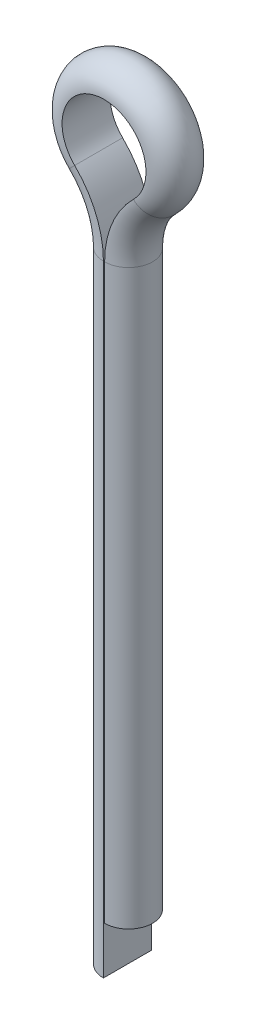
ISO-10303-21;
HEADER;
FILE_DESCRIPTION(('STEP AP214'),'2;1');
FILE_NAME('part.step','',(''),(''),'','','');
FILE_SCHEMA(('AUTOMOTIVE_DESIGN { 1 0 10303 214 1 1 1 1 }'));
ENDSEC;
DATA;
#1=APPLICATION_CONTEXT('core data for automotive mechanical design processes');
#2=APPLICATION_PROTOCOL_DEFINITION('international standard','automotive_design',2000,#1);
#3=PRODUCT_CONTEXT('',#1,'mechanical');
#4=PRODUCT('Part','Part','',(#3));
#5=PRODUCT_RELATED_PRODUCT_CATEGORY('part','',(#4));
#6=PRODUCT_DEFINITION_FORMATION('','',#4);
#7=PRODUCT_DEFINITION_CONTEXT('part definition',#1,'design');
#8=PRODUCT_DEFINITION('design','',#6,#7);
#9=PRODUCT_DEFINITION_SHAPE('','',#8);
#10=(LENGTH_UNIT() NAMED_UNIT(*) SI_UNIT(.MILLI.,.METRE.));
#11=(NAMED_UNIT(*) PLANE_ANGLE_UNIT() SI_UNIT($,.RADIAN.));
#12=(NAMED_UNIT(*) SI_UNIT($,.STERADIAN.) SOLID_ANGLE_UNIT());
#13=UNCERTAINTY_MEASURE_WITH_UNIT(LENGTH_MEASURE(1.E-05),#10,'distance_accuracy_value','');
#14=(GEOMETRIC_REPRESENTATION_CONTEXT(3) GLOBAL_UNCERTAINTY_ASSIGNED_CONTEXT((#13)) GLOBAL_UNIT_ASSIGNED_CONTEXT((#10,
#11,#12)) REPRESENTATION_CONTEXT('',''));
#15=CARTESIAN_POINT('',(0.,0.,0.));
#16=DIRECTION('',(0.,0.,1.));
#17=DIRECTION('',(1.,0.,0.));
#18=AXIS2_PLACEMENT_3D('',#15,#16,#17);
#19=CARTESIAN_POINT('',(-35.7565268699896,29.9749147988003,0.999999999999894));
#20=DIRECTION('',(-1.,0.,0.));
#21=DIRECTION('',(0.,0.,1.));
#22=AXIS2_PLACEMENT_3D('',#19,#20,#21);
#23=PLANE('',#22);
#24=DIRECTION('',(0.,0.,-1.));
#25=VECTOR('',#24,1.);
#26=CARTESIAN_POINT('',(-35.7565268699896,29.9749147988003,0.999999999999894));
#27=LINE('',#26,#25);
#28=CARTESIAN_POINT('',(-35.7565268699896,29.9749147988003,0.999999999999894));
#29=VERTEX_POINT('',#28);
#30=CARTESIAN_POINT('',(-35.7565268699896,29.9749147988003,-1.00000000000011));
#31=VERTEX_POINT('',#30);
#32=EDGE_CURVE('E141',#29,#31,#27,.T.);
#33=ORIENTED_EDGE('',*,*,#32,.F.);
#34=DIRECTION('',(0.,-1.,0.));
#35=VECTOR('',#34,1.);
#36=CARTESIAN_POINT('',(-35.7565268699896,29.9749147988003,0.999999999999894));
#37=LINE('',#36,#35);
#38=CARTESIAN_POINT('',(-35.7565268699896,4.08123614521241,0.999999999999894));
#39=VERTEX_POINT('',#38);
#40=EDGE_CURVE('E44',#29,#39,#37,.T.);
#41=ORIENTED_EDGE('',*,*,#40,.T.);
#42=DIRECTION('',(0.,0.,-1.));
#43=VECTOR('',#42,1.);
#44=CARTESIAN_POINT('',(-35.7565268699896,4.08123614521241,0.999999999999894));
#45=LINE('',#44,#43);
#46=CARTESIAN_POINT('',(-35.7565268699896,4.08123614521241,-1.00000000000011));
#47=VERTEX_POINT('',#46);
#48=EDGE_CURVE('E51',#39,#47,#45,.T.);
#49=ORIENTED_EDGE('',*,*,#48,.T.);
#50=DIRECTION('',(0.,-1.,0.));
#51=VECTOR('',#50,1.);
#52=CARTESIAN_POINT('',(-35.7565268699896,29.9749147988003,-1.00000000000011));
#53=LINE('',#52,#51);
#54=EDGE_CURVE('E11',#31,#47,#53,.T.);
#55=ORIENTED_EDGE('',*,*,#54,.F.);
#56=EDGE_LOOP('',(#33,#41,#49,#55));
#57=FACE_BOUND('',#56,.T.);
#58=ADVANCED_FACE('F37',(#57),#23,.F.);
#59=CARTESIAN_POINT('',(-35.7565268699896,29.9749147988003,-1.06257792384059E-13));
#60=DIRECTION('',(0.,-1.,0.));
#61=DIRECTION('',(1.,0.,0.));
#62=AXIS2_PLACEMENT_3D('',#59,#60,#61);
#63=CYLINDRICAL_SURFACE('',#62,1.);
#64=CARTESIAN_POINT('',(-35.7565268699896,29.9749147988003,-1.06257792384059E-13));
#65=DIRECTION('',(0.,-1.,0.));
#66=DIRECTION('',(1.,0.,0.));
#67=AXIS2_PLACEMENT_3D('',#64,#65,#66);
#68=CIRCLE('',#67,1.);
#69=EDGE_CURVE('E138',#29,#31,#68,.T.);
#70=ORIENTED_EDGE('',*,*,#69,.T.);
#71=ORIENTED_EDGE('',*,*,#54,.T.);
#72=CARTESIAN_POINT('',(-35.7565268699896,4.08123614521241,-1.06257792384059E-13));
#73=DIRECTION('',(0.,-1.,0.));
#74=DIRECTION('',(1.,0.,0.));
#75=AXIS2_PLACEMENT_3D('',#72,#73,#74);
#76=CIRCLE('',#75,1.);
#77=EDGE_CURVE('E57',#39,#47,#76,.T.);
#78=ORIENTED_EDGE('',*,*,#77,.F.);
#79=ORIENTED_EDGE('',*,*,#40,.F.);
#80=EDGE_LOOP('',(#70,#71,#78,#79));
#81=FACE_BOUND('',#80,.T.);
#82=ADVANCED_FACE('F153',(#81),#63,.T.);
#83=CARTESIAN_POINT('',(-39.7565268699896,29.9749147988003,-1.06257792384059E-13));
#84=DIRECTION('',(0.,0.,-1.));
#85=DIRECTION('',(-1.,0.,0.));
#86=AXIS2_PLACEMENT_3D('',#83,#84,#85);
#87=CYLINDRICAL_SURFACE('',#86,4.);
#88=DIRECTION('',(0.,0.,-1.));
#89=VECTOR('',#88,1.);
#90=CARTESIAN_POINT('',(-36.9565268699896,32.8314861702174,0.999999999999894));
#91=LINE('',#90,#89);
#92=CARTESIAN_POINT('',(-36.9565268699896,32.8314861702174,0.999999999999894));
#93=VERTEX_POINT('',#92);
#94=CARTESIAN_POINT('',(-36.9565268699896,32.8314861702174,-1.00000000000011));
#95=VERTEX_POINT('',#94);
#96=EDGE_CURVE('E129',#93,#95,#91,.T.);
#97=ORIENTED_EDGE('',*,*,#96,.F.);
#98=CARTESIAN_POINT('',(-39.7565268699896,29.9749147988003,0.999999999999894));
#99=DIRECTION('',(0.,0.,-1.));
#100=DIRECTION('',(-1.,0.,0.));
#101=AXIS2_PLACEMENT_3D('',#98,#99,#100);
#102=CIRCLE('',#101,4.);
#103=EDGE_CURVE('E144',#93,#29,#102,.T.);
#104=ORIENTED_EDGE('',*,*,#103,.T.);
#105=ORIENTED_EDGE('',*,*,#32,.T.);
#106=CARTESIAN_POINT('',(-39.7565268699896,29.9749147988003,-1.00000000000011));
#107=DIRECTION('',(0.,0.,-1.));
#108=DIRECTION('',(-1.,0.,0.));
#109=AXIS2_PLACEMENT_3D('',#106,#107,#108);
#110=CIRCLE('',#109,4.);
#111=EDGE_CURVE('E147',#95,#31,#110,.T.);
#112=ORIENTED_EDGE('',*,*,#111,.F.);
#113=EDGE_LOOP('',(#97,#104,#105,#112));
#114=FACE_BOUND('',#113,.T.);
#115=ADVANCED_FACE('F157',(#114),#87,.T.);
#116=CARTESIAN_POINT('',(-39.7565268699896,29.9749147988003,-1.06257792384059E-13));
#117=DIRECTION('',(0.,0.,-1.));
#118=DIRECTION('',(-1.,0.,0.));
#119=AXIS2_PLACEMENT_3D('',#116,#117,#118);
#120=TOROIDAL_SURFACE('',#119,4.,1.);
#121=CARTESIAN_POINT('',(-36.9565268699896,32.8314861702174,-1.06257792384059E-13));
#122=DIRECTION('',(0.714142842854295,-0.69999999999999,0.));
#123=DIRECTION('',(0.69999999999999,0.714142842854295,0.));
#124=AXIS2_PLACEMENT_3D('',#121,#122,#123);
#125=CIRCLE('',#124,1.);
#126=EDGE_CURVE('E126',#93,#95,#125,.T.);
#127=ORIENTED_EDGE('',*,*,#126,.T.);
#128=ORIENTED_EDGE('',*,*,#111,.T.);
#129=ORIENTED_EDGE('',*,*,#69,.F.);
#130=ORIENTED_EDGE('',*,*,#103,.F.);
#131=EDGE_LOOP('',(#127,#128,#129,#130));
#132=FACE_BOUND('',#131,.T.);
#133=ADVANCED_FACE('F158',(#132),#120,.T.);
#134=CARTESIAN_POINT('',(-35.7315268699896,34.0812361452124,-1.06257792384059E-13));
#135=DIRECTION('',(0.,0.,1.));
#136=DIRECTION('',(1.,0.,0.));
#137=AXIS2_PLACEMENT_3D('',#134,#135,#136);
#138=CYLINDRICAL_SURFACE('',#137,1.75);
#139=DIRECTION('',(0.,0.,-1.));
#140=VECTOR('',#139,1.);
#141=CARTESIAN_POINT('',(-34.5065268699896,32.8314861702174,0.999999999999894));
#142=LINE('',#141,#140);
#143=CARTESIAN_POINT('',(-34.5065268699896,32.8314861702174,0.999999999999894));
#144=VERTEX_POINT('',#143);
#145=CARTESIAN_POINT('',(-34.5065268699896,32.8314861702174,-1.00000000000011));
#146=VERTEX_POINT('',#145);
#147=EDGE_CURVE('E117',#144,#146,#142,.T.);
#148=ORIENTED_EDGE('',*,*,#147,.F.);
#149=CARTESIAN_POINT('',(-35.7315268699896,34.0812361452124,0.999999999999894));
#150=DIRECTION('',(0.,0.,1.));
#151=DIRECTION('',(1.,0.,0.));
#152=AXIS2_PLACEMENT_3D('',#149,#150,#151);
#153=CIRCLE('',#152,1.75);
#154=EDGE_CURVE('E132',#144,#93,#153,.T.);
#155=ORIENTED_EDGE('',*,*,#154,.T.);
#156=ORIENTED_EDGE('',*,*,#96,.T.);
#157=CARTESIAN_POINT('',(-35.7315268699896,34.0812361452124,-1.00000000000011));
#158=DIRECTION('',(0.,0.,1.));
#159=DIRECTION('',(1.,0.,0.));
#160=AXIS2_PLACEMENT_3D('',#157,#158,#159);
#161=CIRCLE('',#160,1.75);
#162=EDGE_CURVE('E135',#146,#95,#161,.T.);
#163=ORIENTED_EDGE('',*,*,#162,.F.);
#164=EDGE_LOOP('',(#148,#155,#156,#163));
#165=FACE_BOUND('',#164,.T.);
#166=ADVANCED_FACE('F163',(#165),#138,.F.);
#167=CARTESIAN_POINT('',(-35.7315268699896,34.0812361452124,-1.06257792384059E-13));
#168=DIRECTION('',(0.,0.,1.));
#169=DIRECTION('',(1.,0.,0.));
#170=AXIS2_PLACEMENT_3D('',#167,#168,#169);
#171=TOROIDAL_SURFACE('',#170,1.75,1.);
#172=CARTESIAN_POINT('',(-34.5065268699896,32.8314861702174,-1.06257792384059E-13));
#173=DIRECTION('',(0.714142842854285,0.7,0.));
#174=DIRECTION('',(-0.7,0.714142842854285,0.));
#175=AXIS2_PLACEMENT_3D('',#172,#173,#174);
#176=CIRCLE('',#175,1.);
#177=EDGE_CURVE('E99',#144,#146,#176,.T.);
#178=ORIENTED_EDGE('',*,*,#177,.T.);
#179=ORIENTED_EDGE('',*,*,#162,.T.);
#180=ORIENTED_EDGE('',*,*,#126,.F.);
#181=ORIENTED_EDGE('',*,*,#154,.F.);
#182=EDGE_LOOP('',(#178,#179,#180,#181));
#183=FACE_BOUND('',#182,.T.);
#184=ADVANCED_FACE('F164',(#183),#171,.T.);
#185=CARTESIAN_POINT('',(-31.7065268699896,29.9749147988003,-1.06257792384059E-13));
#186=DIRECTION('',(0.,0.,-1.));
#187=DIRECTION('',(-1.,0.,0.));
#188=AXIS2_PLACEMENT_3D('',#185,#186,#187);
#189=CYLINDRICAL_SURFACE('',#188,4.);
#190=DIRECTION('',(0.,0.,-1.));
#191=VECTOR('',#190,1.);
#192=CARTESIAN_POINT('',(-35.7065268699896,29.9749147988003,0.999999999999894));
#193=LINE('',#192,#191);
#194=CARTESIAN_POINT('',(-35.7065268699896,29.9749147988003,0.999999999999894));
#195=VERTEX_POINT('',#194);
#196=CARTESIAN_POINT('',(-35.7065268699896,29.9749147988003,-1.00000000000011));
#197=VERTEX_POINT('',#196);
#198=EDGE_CURVE('E96',#195,#197,#193,.T.);
#199=ORIENTED_EDGE('',*,*,#198,.F.);
#200=CARTESIAN_POINT('',(-31.7065268699896,29.9749147988003,0.999999999999894));
#201=DIRECTION('',(0.,0.,-1.));
#202=DIRECTION('',(-1.,0.,0.));
#203=AXIS2_PLACEMENT_3D('',#200,#201,#202);
#204=CIRCLE('',#203,4.);
#205=EDGE_CURVE('E120',#195,#144,#204,.T.);
#206=ORIENTED_EDGE('',*,*,#205,.T.);
#207=ORIENTED_EDGE('',*,*,#147,.T.);
#208=CARTESIAN_POINT('',(-31.7065268699896,29.9749147988003,-1.00000000000011));
#209=DIRECTION('',(0.,0.,-1.));
#210=DIRECTION('',(-1.,0.,0.));
#211=AXIS2_PLACEMENT_3D('',#208,#209,#210);
#212=CIRCLE('',#211,4.);
#213=EDGE_CURVE('E123',#197,#146,#212,.T.);
#214=ORIENTED_EDGE('',*,*,#213,.F.);
#215=EDGE_LOOP('',(#199,#206,#207,#214));
#216=FACE_BOUND('',#215,.T.);
#217=ADVANCED_FACE('F168',(#216),#189,.T.);
#218=CARTESIAN_POINT('',(-31.7065268699896,29.9749147988003,-1.06257792384059E-13));
#219=DIRECTION('',(0.,0.,-1.));
#220=DIRECTION('',(-1.,0.,0.));
#221=AXIS2_PLACEMENT_3D('',#218,#219,#220);
#222=TOROIDAL_SURFACE('',#221,4.,1.);
#223=CARTESIAN_POINT('',(-35.7065268699896,29.9749147988003,-1.06257792384059E-13));
#224=DIRECTION('',(0.,1.,0.));
#225=DIRECTION('',(-1.,0.,0.));
#226=AXIS2_PLACEMENT_3D('',#223,#224,#225);
#227=CIRCLE('',#226,1.);
#228=EDGE_CURVE('E108',#195,#197,#227,.T.);
#229=ORIENTED_EDGE('',*,*,#228,.T.);
#230=ORIENTED_EDGE('',*,*,#213,.T.);
#231=ORIENTED_EDGE('',*,*,#177,.F.);
#232=ORIENTED_EDGE('',*,*,#205,.F.);
#233=EDGE_LOOP('',(#229,#230,#231,#232));
#234=FACE_BOUND('',#233,.T.);
#235=ADVANCED_FACE('F169',(#234),#222,.T.);
#236=CARTESIAN_POINT('',(-35.7065268699896,29.9749147988003,-1.06257792384059E-13));
#237=DIRECTION('',(0.,-1.,0.));
#238=DIRECTION('',(1.,0.,0.));
#239=AXIS2_PLACEMENT_3D('',#236,#237,#238);
#240=CYLINDRICAL_SURFACE('',#239,1.);
#241=CARTESIAN_POINT('',(-35.7065268699896,6.08123614521243,-1.06257792384059E-13));
#242=DIRECTION('',(0.,1.,0.));
#243=DIRECTION('',(-1.,0.,0.));
#244=AXIS2_PLACEMENT_3D('',#241,#242,#243);
#245=CIRCLE('',#244,1.);
#246=CARTESIAN_POINT('',(-35.7065268699896,6.08123614521243,0.999999999999894));
#247=VERTEX_POINT('',#246);
#248=CARTESIAN_POINT('',(-35.7065268699896,6.08123614521243,-1.00000000000011));
#249=VERTEX_POINT('',#248);
#250=EDGE_CURVE('E103',#247,#249,#245,.T.);
#251=ORIENTED_EDGE('',*,*,#250,.T.);
#252=DIRECTION('',(0.,-1.,0.));
#253=VECTOR('',#252,1.);
#254=CARTESIAN_POINT('',(-35.7065268699896,29.9749147988003,-1.00000000000011));
#255=LINE('',#254,#253);
#256=EDGE_CURVE('E89',#197,#249,#255,.T.);
#257=ORIENTED_EDGE('',*,*,#256,.F.);
#258=ORIENTED_EDGE('',*,*,#228,.F.);
#259=DIRECTION('',(0.,-1.,0.));
#260=VECTOR('',#259,1.);
#261=CARTESIAN_POINT('',(-35.7065268699896,29.9749147988003,0.999999999999894));
#262=LINE('',#261,#260);
#263=EDGE_CURVE('E100',#195,#247,#262,.T.);
#264=ORIENTED_EDGE('',*,*,#263,.T.);
#265=EDGE_LOOP('',(#251,#257,#258,#264));
#266=FACE_BOUND('',#265,.T.);
#267=ADVANCED_FACE('F104',(#266),#240,.T.);
#268=CARTESIAN_POINT('',(-35.7065268699896,29.9749147988003,0.999999999999894));
#269=DIRECTION('',(-1.,0.,0.));
#270=DIRECTION('',(0.,0.,1.));
#271=AXIS2_PLACEMENT_3D('',#268,#269,#270);
#272=PLANE('',#271);
#273=DIRECTION('',(0.,0.,-1.));
#274=VECTOR('',#273,1.);
#275=CARTESIAN_POINT('',(-35.7065268699896,6.08123614521243,0.999999999999894));
#276=LINE('',#275,#274);
#277=EDGE_CURVE('E94',#247,#249,#276,.T.);
#278=ORIENTED_EDGE('',*,*,#277,.F.);
#279=ORIENTED_EDGE('',*,*,#263,.F.);
#280=ORIENTED_EDGE('',*,*,#198,.T.);
#281=ORIENTED_EDGE('',*,*,#256,.T.);
#282=EDGE_LOOP('',(#278,#279,#280,#281));
#283=FACE_BOUND('',#282,.T.);
#284=ADVANCED_FACE('F91',(#283),#272,.T.);
#285=CARTESIAN_POINT('',(-35.7565268699896,4.08123614521241,-1.06257792384059E-13));
#286=DIRECTION('',(0.,-1.,0.));
#287=DIRECTION('',(1.,0.,0.));
#288=AXIS2_PLACEMENT_3D('',#285,#286,#287);
#289=PLANE('',#288);
#290=ORIENTED_EDGE('',*,*,#77,.T.);
#291=ORIENTED_EDGE('',*,*,#48,.F.);
#292=EDGE_LOOP('',(#290,#291));
#293=FACE_BOUND('',#292,.T.);
#294=ADVANCED_FACE('F219',(#293),#289,.T.);
#295=CARTESIAN_POINT('',(-35.7065268699896,6.08123614521243,-1.06257792384059E-13));
#296=DIRECTION('',(0.,1.,0.));
#297=DIRECTION('',(-1.,0.,0.));
#298=AXIS2_PLACEMENT_3D('',#295,#296,#297);
#299=PLANE('',#298);
#300=ORIENTED_EDGE('',*,*,#250,.F.);
#301=ORIENTED_EDGE('',*,*,#277,.T.);
#302=EDGE_LOOP('',(#300,#301));
#303=FACE_BOUND('',#302,.T.);
#304=ADVANCED_FACE('F107',(#303),#299,.F.);
#305=CLOSED_SHELL('',(#58,#82,#115,#133,#166,#184,#217,#235,#267,#284,#294,#304));
#306=MANIFOLD_SOLID_BREP('B2',#305);
#307=ADVANCED_BREP_SHAPE_REPRESENTATION('',(#18,#306),#14);
#308=SHAPE_DEFINITION_REPRESENTATION(#9,#307);
ENDSEC;
END-ISO-10303-21;
